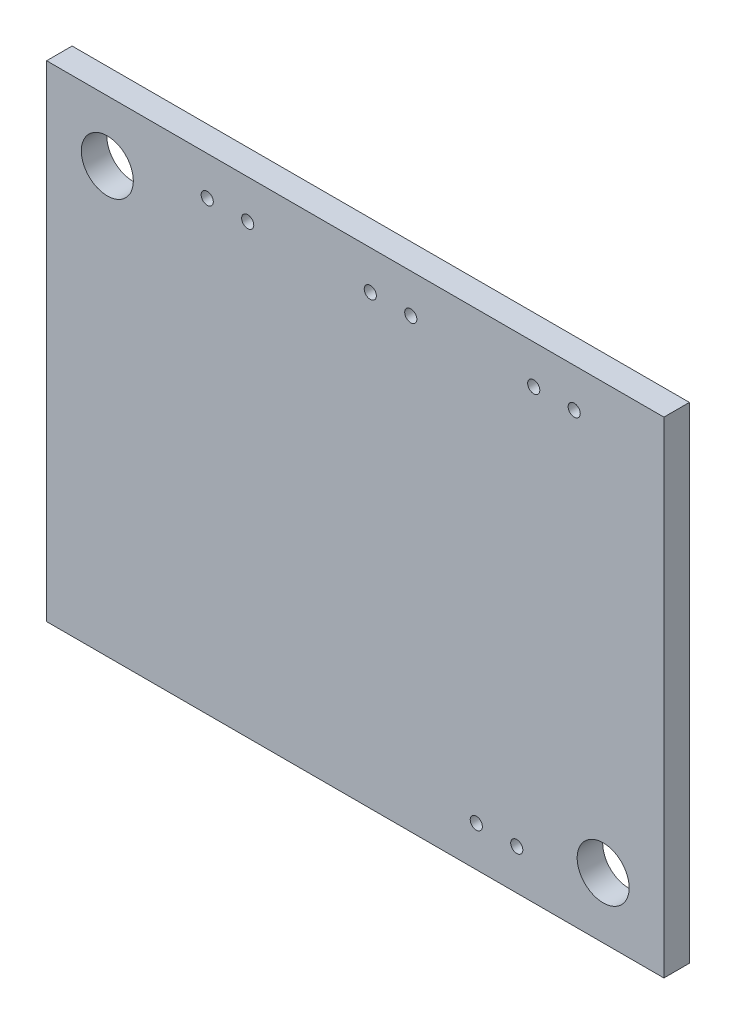
ISO-10303-21;
HEADER;
FILE_DESCRIPTION(('STEP AP214'),'2;1');
FILE_NAME('part.step','',(''),(''),'','','');
FILE_SCHEMA(('AUTOMOTIVE_DESIGN { 1 0 10303 214 1 1 1 1 }'));
ENDSEC;
DATA;
#1=APPLICATION_CONTEXT('core data for automotive mechanical design processes');
#2=APPLICATION_PROTOCOL_DEFINITION('international standard','automotive_design',2000,#1);
#3=PRODUCT_CONTEXT('',#1,'mechanical');
#4=PRODUCT('Part','Part','',(#3));
#5=PRODUCT_RELATED_PRODUCT_CATEGORY('part','',(#4));
#6=PRODUCT_DEFINITION_FORMATION('','',#4);
#7=PRODUCT_DEFINITION_CONTEXT('part definition',#1,'design');
#8=PRODUCT_DEFINITION('design','',#6,#7);
#9=PRODUCT_DEFINITION_SHAPE('','',#8);
#10=(LENGTH_UNIT() NAMED_UNIT(*) SI_UNIT(.MILLI.,.METRE.));
#11=(NAMED_UNIT(*) PLANE_ANGLE_UNIT() SI_UNIT($,.RADIAN.));
#12=(NAMED_UNIT(*) SI_UNIT($,.STERADIAN.) SOLID_ANGLE_UNIT());
#13=UNCERTAINTY_MEASURE_WITH_UNIT(LENGTH_MEASURE(1.E-05),#10,'distance_accuracy_value','');
#14=(GEOMETRIC_REPRESENTATION_CONTEXT(3) GLOBAL_UNCERTAINTY_ASSIGNED_CONTEXT((#13)) GLOBAL_UNIT_ASSIGNED_CONTEXT((#10,
#11,#12)) REPRESENTATION_CONTEXT('',''));
#15=CARTESIAN_POINT('',(0.,0.,0.));
#16=DIRECTION('',(0.,0.,1.));
#17=DIRECTION('',(1.,0.,0.));
#18=AXIS2_PLACEMENT_3D('',#15,#16,#17);
#19=CARTESIAN_POINT('',(19.3675,-15.24,0.8));
#20=DIRECTION('',(-1.,0.,0.));
#21=DIRECTION('',(0.,0.,1.));
#22=AXIS2_PLACEMENT_3D('',#19,#20,#21);
#23=PLANE('',#22);
#24=DIRECTION('',(0.,1.,0.));
#25=VECTOR('',#24,1.);
#26=CARTESIAN_POINT('',(19.3675,-15.24,-0.8));
#27=LINE('',#26,#25);
#28=CARTESIAN_POINT('',(19.3675,-15.24,-0.8));
#29=VERTEX_POINT('',#28);
#30=CARTESIAN_POINT('',(19.3675,15.24,-0.8));
#31=VERTEX_POINT('',#30);
#32=EDGE_CURVE('E98',#29,#31,#27,.T.);
#33=ORIENTED_EDGE('',*,*,#32,.T.);
#34=DIRECTION('',(0.,0.,-1.));
#35=VECTOR('',#34,1.);
#36=CARTESIAN_POINT('',(19.3675,15.24,0.8));
#37=LINE('',#36,#35);
#38=CARTESIAN_POINT('',(19.3675,15.24,0.8));
#39=VERTEX_POINT('',#38);
#40=EDGE_CURVE('E11',#39,#31,#37,.T.);
#41=ORIENTED_EDGE('',*,*,#40,.F.);
#42=DIRECTION('',(0.,1.,0.));
#43=VECTOR('',#42,1.);
#44=CARTESIAN_POINT('',(19.3675,-15.24,0.8));
#45=LINE('',#44,#43);
#46=CARTESIAN_POINT('',(19.3675,-15.24,0.8));
#47=VERTEX_POINT('',#46);
#48=EDGE_CURVE('E85',#47,#39,#45,.T.);
#49=ORIENTED_EDGE('',*,*,#48,.F.);
#50=DIRECTION('',(0.,0.,-1.));
#51=VECTOR('',#50,1.);
#52=CARTESIAN_POINT('',(19.3675,-15.24,0.8));
#53=LINE('',#52,#51);
#54=EDGE_CURVE('E94',#47,#29,#53,.T.);
#55=ORIENTED_EDGE('',*,*,#54,.T.);
#56=EDGE_LOOP('',(#33,#41,#49,#55));
#57=FACE_BOUND('',#56,.T.);
#58=ADVANCED_FACE('F33',(#57),#23,.F.);
#59=CARTESIAN_POINT('',(-19.3675,15.24,0.8));
#60=DIRECTION('',(0.,-1.,0.));
#61=DIRECTION('',(0.,0.,-1.));
#62=AXIS2_PLACEMENT_3D('',#59,#60,#61);
#63=PLANE('',#62);
#64=DIRECTION('',(-1.,0.,0.));
#65=VECTOR('',#64,1.);
#66=CARTESIAN_POINT('',(-19.3675,15.24,-0.8));
#67=LINE('',#66,#65);
#68=CARTESIAN_POINT('',(-19.3675,15.24,-0.8));
#69=VERTEX_POINT('',#68);
#70=EDGE_CURVE('E89',#31,#69,#67,.T.);
#71=ORIENTED_EDGE('',*,*,#70,.T.);
#72=DIRECTION('',(0.,0.,-1.));
#73=VECTOR('',#72,1.);
#74=CARTESIAN_POINT('',(-19.3675,15.24,0.8));
#75=LINE('',#74,#73);
#76=CARTESIAN_POINT('',(-19.3675,15.24,0.8));
#77=VERTEX_POINT('',#76);
#78=EDGE_CURVE('E42',#77,#69,#75,.T.);
#79=ORIENTED_EDGE('',*,*,#78,.F.);
#80=DIRECTION('',(-1.,0.,0.));
#81=VECTOR('',#80,1.);
#82=CARTESIAN_POINT('',(-19.3675,15.24,0.8));
#83=LINE('',#82,#81);
#84=EDGE_CURVE('E80',#39,#77,#83,.T.);
#85=ORIENTED_EDGE('',*,*,#84,.F.);
#86=ORIENTED_EDGE('',*,*,#40,.T.);
#87=EDGE_LOOP('',(#71,#79,#85,#86));
#88=FACE_BOUND('',#87,.T.);
#89=ADVANCED_FACE('F88',(#88),#63,.F.);
#90=CARTESIAN_POINT('',(-19.3675,-15.24,0.8));
#91=DIRECTION('',(1.,0.,0.));
#92=DIRECTION('',(0.,0.,-1.));
#93=AXIS2_PLACEMENT_3D('',#90,#91,#92);
#94=PLANE('',#93);
#95=DIRECTION('',(0.,-1.,0.));
#96=VECTOR('',#95,1.);
#97=CARTESIAN_POINT('',(-19.3675,-15.24,-0.8));
#98=LINE('',#97,#96);
#99=CARTESIAN_POINT('',(-19.3675,-15.24,-0.8));
#100=VERTEX_POINT('',#99);
#101=EDGE_CURVE('E67',#69,#100,#98,.T.);
#102=ORIENTED_EDGE('',*,*,#101,.T.);
#103=DIRECTION('',(0.,0.,-1.));
#104=VECTOR('',#103,1.);
#105=CARTESIAN_POINT('',(-19.3675,-15.24,0.8));
#106=LINE('',#105,#104);
#107=CARTESIAN_POINT('',(-19.3675,-15.24,0.8));
#108=VERTEX_POINT('',#107);
#109=EDGE_CURVE('E90',#108,#100,#106,.T.);
#110=ORIENTED_EDGE('',*,*,#109,.F.);
#111=DIRECTION('',(0.,-1.,0.));
#112=VECTOR('',#111,1.);
#113=CARTESIAN_POINT('',(-19.3675,-15.24,0.8));
#114=LINE('',#113,#112);
#115=EDGE_CURVE('E83',#77,#108,#114,.T.);
#116=ORIENTED_EDGE('',*,*,#115,.F.);
#117=ORIENTED_EDGE('',*,*,#78,.T.);
#118=EDGE_LOOP('',(#102,#110,#116,#117));
#119=FACE_BOUND('',#118,.T.);
#120=ADVANCED_FACE('F92',(#119),#94,.F.);
#121=CARTESIAN_POINT('',(-19.3675,-15.24,0.8));
#122=DIRECTION('',(0.,1.,0.));
#123=DIRECTION('',(0.,0.,1.));
#124=AXIS2_PLACEMENT_3D('',#121,#122,#123);
#125=PLANE('',#124);
#126=DIRECTION('',(1.,0.,0.));
#127=VECTOR('',#126,1.);
#128=CARTESIAN_POINT('',(-19.3675,-15.24,-0.8));
#129=LINE('',#128,#127);
#130=EDGE_CURVE('E73',#100,#29,#129,.T.);
#131=ORIENTED_EDGE('',*,*,#130,.T.);
#132=ORIENTED_EDGE('',*,*,#54,.F.);
#133=DIRECTION('',(1.,0.,0.));
#134=VECTOR('',#133,1.);
#135=CARTESIAN_POINT('',(-19.3675,-15.24,0.8));
#136=LINE('',#135,#134);
#137=EDGE_CURVE('E50',#108,#47,#136,.T.);
#138=ORIENTED_EDGE('',*,*,#137,.F.);
#139=ORIENTED_EDGE('',*,*,#109,.T.);
#140=EDGE_LOOP('',(#131,#132,#138,#139));
#141=FACE_BOUND('',#140,.T.);
#142=ADVANCED_FACE('F106',(#141),#125,.F.);
#143=CARTESIAN_POINT('',(19.3675,15.24,0.8));
#144=DIRECTION('',(0.,0.,-1.));
#145=DIRECTION('',(-1.,0.,0.));
#146=AXIS2_PLACEMENT_3D('',#143,#144,#145);
#147=PLANE('',#146);
#148=CARTESIAN_POINT('',(10.1355326301999,-12.7093295530093,0.8));
#149=DIRECTION('',(0.,0.,1.));
#150=DIRECTION('',(1.,0.,0.));
#151=AXIS2_PLACEMENT_3D('',#148,#149,#150);
#152=CIRCLE('',#151,0.381);
#153=CARTESIAN_POINT('',(10.5165326301999,-12.7093295530093,0.8));
#154=VERTEX_POINT('',#153);
#155=EDGE_CURVE('E163',#154,#154,#152,.T.);
#156=ORIENTED_EDGE('',*,*,#155,.F.);
#157=EDGE_LOOP('',(#156));
#158=FACE_BOUND('',#157,.T.);
#159=CARTESIAN_POINT('',(7.59553263019987,-12.7093295530093,0.8));
#160=DIRECTION('',(0.,0.,1.));
#161=DIRECTION('',(1.,0.,0.));
#162=AXIS2_PLACEMENT_3D('',#159,#160,#161);
#163=CIRCLE('',#162,0.381);
#164=CARTESIAN_POINT('',(7.97653263019987,-12.7093295530093,0.8));
#165=VERTEX_POINT('',#164);
#166=EDGE_CURVE('E157',#165,#165,#163,.T.);
#167=ORIENTED_EDGE('',*,*,#166,.F.);
#168=EDGE_LOOP('',(#167));
#169=FACE_BOUND('',#168,.T.);
#170=CARTESIAN_POINT('',(13.7380230398473,12.8049782290539,0.8));
#171=DIRECTION('',(0.,0.,1.));
#172=DIRECTION('',(1.,0.,0.));
#173=AXIS2_PLACEMENT_3D('',#170,#171,#172);
#174=CIRCLE('',#173,0.381);
#175=CARTESIAN_POINT('',(14.1190230398473,12.8049782290539,0.8));
#176=VERTEX_POINT('',#175);
#177=EDGE_CURVE('E151',#176,#176,#174,.T.);
#178=ORIENTED_EDGE('',*,*,#177,.F.);
#179=EDGE_LOOP('',(#178));
#180=FACE_BOUND('',#179,.T.);
#181=CARTESIAN_POINT('',(11.1980230398473,12.8049782290539,0.8));
#182=DIRECTION('',(0.,0.,1.));
#183=DIRECTION('',(1.,0.,0.));
#184=AXIS2_PLACEMENT_3D('',#181,#182,#183);
#185=CIRCLE('',#184,0.381);
#186=CARTESIAN_POINT('',(11.5790230398473,12.8049782290539,0.8));
#187=VERTEX_POINT('',#186);
#188=EDGE_CURVE('E145',#187,#187,#185,.T.);
#189=ORIENTED_EDGE('',*,*,#188,.F.);
#190=EDGE_LOOP('',(#189));
#191=FACE_BOUND('',#190,.T.);
#192=CARTESIAN_POINT('',(3.4838211653284,12.8049782290539,0.8));
#193=DIRECTION('',(0.,0.,1.));
#194=DIRECTION('',(1.,0.,0.));
#195=AXIS2_PLACEMENT_3D('',#192,#193,#194);
#196=CIRCLE('',#195,0.381);
#197=CARTESIAN_POINT('',(3.8648211653284,12.8049782290539,0.8));
#198=VERTEX_POINT('',#197);
#199=EDGE_CURVE('E139',#198,#198,#196,.T.);
#200=ORIENTED_EDGE('',*,*,#199,.F.);
#201=EDGE_LOOP('',(#200));
#202=FACE_BOUND('',#201,.T.);
#203=CARTESIAN_POINT('',(0.943821165328401,12.8049782290539,0.8));
#204=DIRECTION('',(0.,0.,1.));
#205=DIRECTION('',(1.,0.,0.));
#206=AXIS2_PLACEMENT_3D('',#203,#204,#205);
#207=CIRCLE('',#206,0.381);
#208=CARTESIAN_POINT('',(1.3248211653284,12.8049782290539,0.8));
#209=VERTEX_POINT('',#208);
#210=EDGE_CURVE('E133',#209,#209,#207,.T.);
#211=ORIENTED_EDGE('',*,*,#210,.F.);
#212=EDGE_LOOP('',(#211));
#213=FACE_BOUND('',#212,.T.);
#214=CARTESIAN_POINT('',(-6.74940429158493,12.8049782290539,0.8));
#215=DIRECTION('',(0.,0.,1.));
#216=DIRECTION('',(1.,0.,0.));
#217=AXIS2_PLACEMENT_3D('',#214,#215,#216);
#218=CIRCLE('',#217,0.381000000000001);
#219=CARTESIAN_POINT('',(-6.36840429158493,12.8049782290539,0.8));
#220=VERTEX_POINT('',#219);
#221=EDGE_CURVE('E127',#220,#220,#218,.T.);
#222=ORIENTED_EDGE('',*,*,#221,.F.);
#223=EDGE_LOOP('',(#222));
#224=FACE_BOUND('',#223,.T.);
#225=CARTESIAN_POINT('',(-9.28940429158493,12.8049782290539,0.8));
#226=DIRECTION('',(0.,0.,1.));
#227=DIRECTION('',(1.,0.,0.));
#228=AXIS2_PLACEMENT_3D('',#225,#226,#227);
#229=CIRCLE('',#228,0.381);
#230=CARTESIAN_POINT('',(-8.90840429158493,12.8049782290539,0.8));
#231=VERTEX_POINT('',#230);
#232=EDGE_CURVE('E121',#231,#231,#229,.T.);
#233=ORIENTED_EDGE('',*,*,#232,.F.);
#234=EDGE_LOOP('',(#233));
#235=FACE_BOUND('',#234,.T.);
#236=CARTESIAN_POINT('',(-15.5575,11.43,0.8));
#237=DIRECTION('',(0.,0.,1.));
#238=DIRECTION('',(1.,0.,0.));
#239=AXIS2_PLACEMENT_3D('',#236,#237,#238);
#240=CIRCLE('',#239,1.63195);
#241=CARTESIAN_POINT('',(-13.92555,11.43,0.8));
#242=VERTEX_POINT('',#241);
#243=EDGE_CURVE('E117',#242,#242,#240,.T.);
#244=ORIENTED_EDGE('',*,*,#243,.F.);
#245=EDGE_LOOP('',(#244));
#246=FACE_BOUND('',#245,.T.);
#247=CARTESIAN_POINT('',(15.5575,-11.43,0.8));
#248=DIRECTION('',(0.,0.,1.));
#249=DIRECTION('',(1.,0.,0.));
#250=AXIS2_PLACEMENT_3D('',#247,#248,#249);
#251=CIRCLE('',#250,1.63195);
#252=CARTESIAN_POINT('',(17.18945,-11.43,0.8));
#253=VERTEX_POINT('',#252);
#254=EDGE_CURVE('E114',#253,#253,#251,.T.);
#255=ORIENTED_EDGE('',*,*,#254,.F.);
#256=EDGE_LOOP('',(#255));
#257=FACE_BOUND('',#256,.T.);
#258=ORIENTED_EDGE('',*,*,#48,.T.);
#259=ORIENTED_EDGE('',*,*,#84,.T.);
#260=ORIENTED_EDGE('',*,*,#115,.T.);
#261=ORIENTED_EDGE('',*,*,#137,.T.);
#262=EDGE_LOOP('',(#258,#259,#260,#261));
#263=FACE_BOUND('',#262,.T.);
#264=ADVANCED_FACE('F81',(#158,#169,#180,#191,#202,#213,#224,#235,#246,#257,#263),#147,.F.);
#265=CARTESIAN_POINT('',(19.3675,15.24,-0.8));
#266=DIRECTION('',(0.,0.,-1.));
#267=DIRECTION('',(-1.,0.,0.));
#268=AXIS2_PLACEMENT_3D('',#265,#266,#267);
#269=PLANE('',#268);
#270=CARTESIAN_POINT('',(10.1355326301999,-12.7093295530093,-0.8));
#271=DIRECTION('',(0.,0.,1.));
#272=DIRECTION('',(1.,0.,0.));
#273=AXIS2_PLACEMENT_3D('',#270,#271,#272);
#274=CIRCLE('',#273,0.381);
#275=CARTESIAN_POINT('',(10.5165326301999,-12.7093295530093,-0.8));
#276=VERTEX_POINT('',#275);
#277=EDGE_CURVE('E160',#276,#276,#274,.T.);
#278=ORIENTED_EDGE('',*,*,#277,.T.);
#279=EDGE_LOOP('',(#278));
#280=FACE_BOUND('',#279,.T.);
#281=CARTESIAN_POINT('',(7.59553263019987,-12.7093295530093,-0.8));
#282=DIRECTION('',(0.,0.,1.));
#283=DIRECTION('',(1.,0.,0.));
#284=AXIS2_PLACEMENT_3D('',#281,#282,#283);
#285=CIRCLE('',#284,0.381);
#286=CARTESIAN_POINT('',(7.97653263019987,-12.7093295530093,-0.8));
#287=VERTEX_POINT('',#286);
#288=EDGE_CURVE('E154',#287,#287,#285,.T.);
#289=ORIENTED_EDGE('',*,*,#288,.T.);
#290=EDGE_LOOP('',(#289));
#291=FACE_BOUND('',#290,.T.);
#292=CARTESIAN_POINT('',(13.7380230398473,12.8049782290539,-0.8));
#293=DIRECTION('',(0.,0.,1.));
#294=DIRECTION('',(1.,0.,0.));
#295=AXIS2_PLACEMENT_3D('',#292,#293,#294);
#296=CIRCLE('',#295,0.381);
#297=CARTESIAN_POINT('',(14.1190230398473,12.8049782290539,-0.8));
#298=VERTEX_POINT('',#297);
#299=EDGE_CURVE('E148',#298,#298,#296,.T.);
#300=ORIENTED_EDGE('',*,*,#299,.T.);
#301=EDGE_LOOP('',(#300));
#302=FACE_BOUND('',#301,.T.);
#303=CARTESIAN_POINT('',(11.1980230398473,12.8049782290539,-0.8));
#304=DIRECTION('',(0.,0.,1.));
#305=DIRECTION('',(1.,0.,0.));
#306=AXIS2_PLACEMENT_3D('',#303,#304,#305);
#307=CIRCLE('',#306,0.381);
#308=CARTESIAN_POINT('',(11.5790230398473,12.8049782290539,-0.8));
#309=VERTEX_POINT('',#308);
#310=EDGE_CURVE('E142',#309,#309,#307,.T.);
#311=ORIENTED_EDGE('',*,*,#310,.T.);
#312=EDGE_LOOP('',(#311));
#313=FACE_BOUND('',#312,.T.);
#314=CARTESIAN_POINT('',(3.4838211653284,12.8049782290539,-0.8));
#315=DIRECTION('',(0.,0.,1.));
#316=DIRECTION('',(1.,0.,0.));
#317=AXIS2_PLACEMENT_3D('',#314,#315,#316);
#318=CIRCLE('',#317,0.381);
#319=CARTESIAN_POINT('',(3.8648211653284,12.8049782290539,-0.8));
#320=VERTEX_POINT('',#319);
#321=EDGE_CURVE('E136',#320,#320,#318,.T.);
#322=ORIENTED_EDGE('',*,*,#321,.T.);
#323=EDGE_LOOP('',(#322));
#324=FACE_BOUND('',#323,.T.);
#325=CARTESIAN_POINT('',(0.943821165328401,12.8049782290539,-0.8));
#326=DIRECTION('',(0.,0.,1.));
#327=DIRECTION('',(1.,0.,0.));
#328=AXIS2_PLACEMENT_3D('',#325,#326,#327);
#329=CIRCLE('',#328,0.381);
#330=CARTESIAN_POINT('',(1.3248211653284,12.8049782290539,-0.8));
#331=VERTEX_POINT('',#330);
#332=EDGE_CURVE('E130',#331,#331,#329,.T.);
#333=ORIENTED_EDGE('',*,*,#332,.T.);
#334=EDGE_LOOP('',(#333));
#335=FACE_BOUND('',#334,.T.);
#336=CARTESIAN_POINT('',(-6.74940429158493,12.8049782290539,-0.8));
#337=DIRECTION('',(0.,0.,1.));
#338=DIRECTION('',(1.,0.,0.));
#339=AXIS2_PLACEMENT_3D('',#336,#337,#338);
#340=CIRCLE('',#339,0.381000000000001);
#341=CARTESIAN_POINT('',(-6.36840429158493,12.8049782290539,-0.8));
#342=VERTEX_POINT('',#341);
#343=EDGE_CURVE('E124',#342,#342,#340,.T.);
#344=ORIENTED_EDGE('',*,*,#343,.T.);
#345=EDGE_LOOP('',(#344));
#346=FACE_BOUND('',#345,.T.);
#347=CARTESIAN_POINT('',(-9.28940429158493,12.8049782290539,-0.8));
#348=DIRECTION('',(0.,0.,1.));
#349=DIRECTION('',(1.,0.,0.));
#350=AXIS2_PLACEMENT_3D('',#347,#348,#349);
#351=CIRCLE('',#350,0.381);
#352=CARTESIAN_POINT('',(-8.90840429158493,12.8049782290539,-0.8));
#353=VERTEX_POINT('',#352);
#354=EDGE_CURVE('E120',#353,#353,#351,.T.);
#355=ORIENTED_EDGE('',*,*,#354,.T.);
#356=EDGE_LOOP('',(#355));
#357=FACE_BOUND('',#356,.T.);
#358=CARTESIAN_POINT('',(-15.5575,11.43,-0.8));
#359=DIRECTION('',(0.,0.,-1.));
#360=DIRECTION('',(-1.,0.,0.));
#361=AXIS2_PLACEMENT_3D('',#358,#359,#360);
#362=CIRCLE('',#361,1.63195);
#363=CARTESIAN_POINT('',(-17.18945,11.43,-0.8));
#364=VERTEX_POINT('',#363);
#365=EDGE_CURVE('E36',#364,#364,#362,.T.);
#366=ORIENTED_EDGE('',*,*,#365,.F.);
#367=EDGE_LOOP('',(#366));
#368=FACE_BOUND('',#367,.T.);
#369=CARTESIAN_POINT('',(15.5575,-11.43,-0.8));
#370=DIRECTION('',(0.,0.,-1.));
#371=DIRECTION('',(-1.,0.,0.));
#372=AXIS2_PLACEMENT_3D('',#369,#370,#371);
#373=CIRCLE('',#372,1.63195);
#374=CARTESIAN_POINT('',(13.92555,-11.43,-0.8));
#375=VERTEX_POINT('',#374);
#376=EDGE_CURVE('E101',#375,#375,#373,.T.);
#377=ORIENTED_EDGE('',*,*,#376,.F.);
#378=EDGE_LOOP('',(#377));
#379=FACE_BOUND('',#378,.T.);
#380=ORIENTED_EDGE('',*,*,#32,.F.);
#381=ORIENTED_EDGE('',*,*,#130,.F.);
#382=ORIENTED_EDGE('',*,*,#101,.F.);
#383=ORIENTED_EDGE('',*,*,#70,.F.);
#384=EDGE_LOOP('',(#380,#381,#382,#383));
#385=FACE_BOUND('',#384,.T.);
#386=ADVANCED_FACE('F109',(#280,#291,#302,#313,#324,#335,#346,#357,#368,#379,#385),#269,.T.);
#387=CARTESIAN_POINT('',(15.5575,-11.43,0.8));
#388=DIRECTION('',(0.,0.,1.));
#389=DIRECTION('',(1.,0.,0.));
#390=AXIS2_PLACEMENT_3D('',#387,#388,#389);
#391=CYLINDRICAL_SURFACE('',#390,1.63195);
#392=ORIENTED_EDGE('',*,*,#376,.T.);
#393=EDGE_LOOP('',(#392));
#394=FACE_BOUND('',#393,.T.);
#395=ORIENTED_EDGE('',*,*,#254,.T.);
#396=EDGE_LOOP('',(#395));
#397=FACE_BOUND('',#396,.T.);
#398=ADVANCED_FACE('F199',(#394,#397),#391,.F.);
#399=CARTESIAN_POINT('',(-15.5575,11.43,0.8));
#400=DIRECTION('',(0.,0.,1.));
#401=DIRECTION('',(1.,0.,0.));
#402=AXIS2_PLACEMENT_3D('',#399,#400,#401);
#403=CYLINDRICAL_SURFACE('',#402,1.63195);
#404=ORIENTED_EDGE('',*,*,#365,.T.);
#405=EDGE_LOOP('',(#404));
#406=FACE_BOUND('',#405,.T.);
#407=ORIENTED_EDGE('',*,*,#243,.T.);
#408=EDGE_LOOP('',(#407));
#409=FACE_BOUND('',#408,.T.);
#410=ADVANCED_FACE('F201',(#406,#409),#403,.F.);
#411=CARTESIAN_POINT('',(-9.28940429158493,12.8049782290539,-0.8));
#412=DIRECTION('',(0.,0.,1.));
#413=DIRECTION('',(1.,0.,0.));
#414=AXIS2_PLACEMENT_3D('',#411,#412,#413);
#415=CYLINDRICAL_SURFACE('',#414,0.381);
#416=ORIENTED_EDGE('',*,*,#354,.F.);
#417=EDGE_LOOP('',(#416));
#418=FACE_BOUND('',#417,.T.);
#419=ORIENTED_EDGE('',*,*,#232,.T.);
#420=EDGE_LOOP('',(#419));
#421=FACE_BOUND('',#420,.T.);
#422=ADVANCED_FACE('F208',(#418,#421),#415,.F.);
#423=CARTESIAN_POINT('',(-6.74940429158493,12.8049782290539,-0.8));
#424=DIRECTION('',(0.,0.,1.));
#425=DIRECTION('',(1.,0.,0.));
#426=AXIS2_PLACEMENT_3D('',#423,#424,#425);
#427=CYLINDRICAL_SURFACE('',#426,0.381000000000001);
#428=ORIENTED_EDGE('',*,*,#343,.F.);
#429=EDGE_LOOP('',(#428));
#430=FACE_BOUND('',#429,.T.);
#431=ORIENTED_EDGE('',*,*,#221,.T.);
#432=EDGE_LOOP('',(#431));
#433=FACE_BOUND('',#432,.T.);
#434=ADVANCED_FACE('F247',(#430,#433),#427,.F.);
#435=CARTESIAN_POINT('',(0.943821165328401,12.8049782290539,-0.8));
#436=DIRECTION('',(0.,0.,1.));
#437=DIRECTION('',(1.,0.,0.));
#438=AXIS2_PLACEMENT_3D('',#435,#436,#437);
#439=CYLINDRICAL_SURFACE('',#438,0.381);
#440=ORIENTED_EDGE('',*,*,#332,.F.);
#441=EDGE_LOOP('',(#440));
#442=FACE_BOUND('',#441,.T.);
#443=ORIENTED_EDGE('',*,*,#210,.T.);
#444=EDGE_LOOP('',(#443));
#445=FACE_BOUND('',#444,.T.);
#446=ADVANCED_FACE('F258',(#442,#445),#439,.F.);
#447=CARTESIAN_POINT('',(3.4838211653284,12.8049782290539,-0.8));
#448=DIRECTION('',(0.,0.,1.));
#449=DIRECTION('',(1.,0.,0.));
#450=AXIS2_PLACEMENT_3D('',#447,#448,#449);
#451=CYLINDRICAL_SURFACE('',#450,0.381);
#452=ORIENTED_EDGE('',*,*,#321,.F.);
#453=EDGE_LOOP('',(#452));
#454=FACE_BOUND('',#453,.T.);
#455=ORIENTED_EDGE('',*,*,#199,.T.);
#456=EDGE_LOOP('',(#455));
#457=FACE_BOUND('',#456,.T.);
#458=ADVANCED_FACE('F268',(#454,#457),#451,.F.);
#459=CARTESIAN_POINT('',(11.1980230398473,12.8049782290539,-0.8));
#460=DIRECTION('',(0.,0.,1.));
#461=DIRECTION('',(1.,0.,0.));
#462=AXIS2_PLACEMENT_3D('',#459,#460,#461);
#463=CYLINDRICAL_SURFACE('',#462,0.381);
#464=ORIENTED_EDGE('',*,*,#310,.F.);
#465=EDGE_LOOP('',(#464));
#466=FACE_BOUND('',#465,.T.);
#467=ORIENTED_EDGE('',*,*,#188,.T.);
#468=EDGE_LOOP('',(#467));
#469=FACE_BOUND('',#468,.T.);
#470=ADVANCED_FACE('F278',(#466,#469),#463,.F.);
#471=CARTESIAN_POINT('',(13.7380230398473,12.8049782290539,-0.8));
#472=DIRECTION('',(0.,0.,1.));
#473=DIRECTION('',(1.,0.,0.));
#474=AXIS2_PLACEMENT_3D('',#471,#472,#473);
#475=CYLINDRICAL_SURFACE('',#474,0.381);
#476=ORIENTED_EDGE('',*,*,#299,.F.);
#477=EDGE_LOOP('',(#476));
#478=FACE_BOUND('',#477,.T.);
#479=ORIENTED_EDGE('',*,*,#177,.T.);
#480=EDGE_LOOP('',(#479));
#481=FACE_BOUND('',#480,.T.);
#482=ADVANCED_FACE('F288',(#478,#481),#475,.F.);
#483=CARTESIAN_POINT('',(7.59553263019987,-12.7093295530093,-0.8));
#484=DIRECTION('',(0.,0.,1.));
#485=DIRECTION('',(1.,0.,0.));
#486=AXIS2_PLACEMENT_3D('',#483,#484,#485);
#487=CYLINDRICAL_SURFACE('',#486,0.381);
#488=ORIENTED_EDGE('',*,*,#288,.F.);
#489=EDGE_LOOP('',(#488));
#490=FACE_BOUND('',#489,.T.);
#491=ORIENTED_EDGE('',*,*,#166,.T.);
#492=EDGE_LOOP('',(#491));
#493=FACE_BOUND('',#492,.T.);
#494=ADVANCED_FACE('F174',(#490,#493),#487,.F.);
#495=CARTESIAN_POINT('',(10.1355326301999,-12.7093295530093,-0.8));
#496=DIRECTION('',(0.,0.,1.));
#497=DIRECTION('',(1.,0.,0.));
#498=AXIS2_PLACEMENT_3D('',#495,#496,#497);
#499=CYLINDRICAL_SURFACE('',#498,0.381);
#500=ORIENTED_EDGE('',*,*,#277,.F.);
#501=EDGE_LOOP('',(#500));
#502=FACE_BOUND('',#501,.T.);
#503=ORIENTED_EDGE('',*,*,#155,.T.);
#504=EDGE_LOOP('',(#503));
#505=FACE_BOUND('',#504,.T.);
#506=ADVANCED_FACE('F171',(#502,#505),#499,.F.);
#507=CLOSED_SHELL('',(#58,#89,#120,#142,#264,#386,#398,#410,#422,#434,#446,#458,#470,#482,#494,#506));
#508=MANIFOLD_SOLID_BREP('B2',#507);
#509=ADVANCED_BREP_SHAPE_REPRESENTATION('',(#18,#508),#14);
#510=SHAPE_DEFINITION_REPRESENTATION(#9,#509);
ENDSEC;
END-ISO-10303-21;
